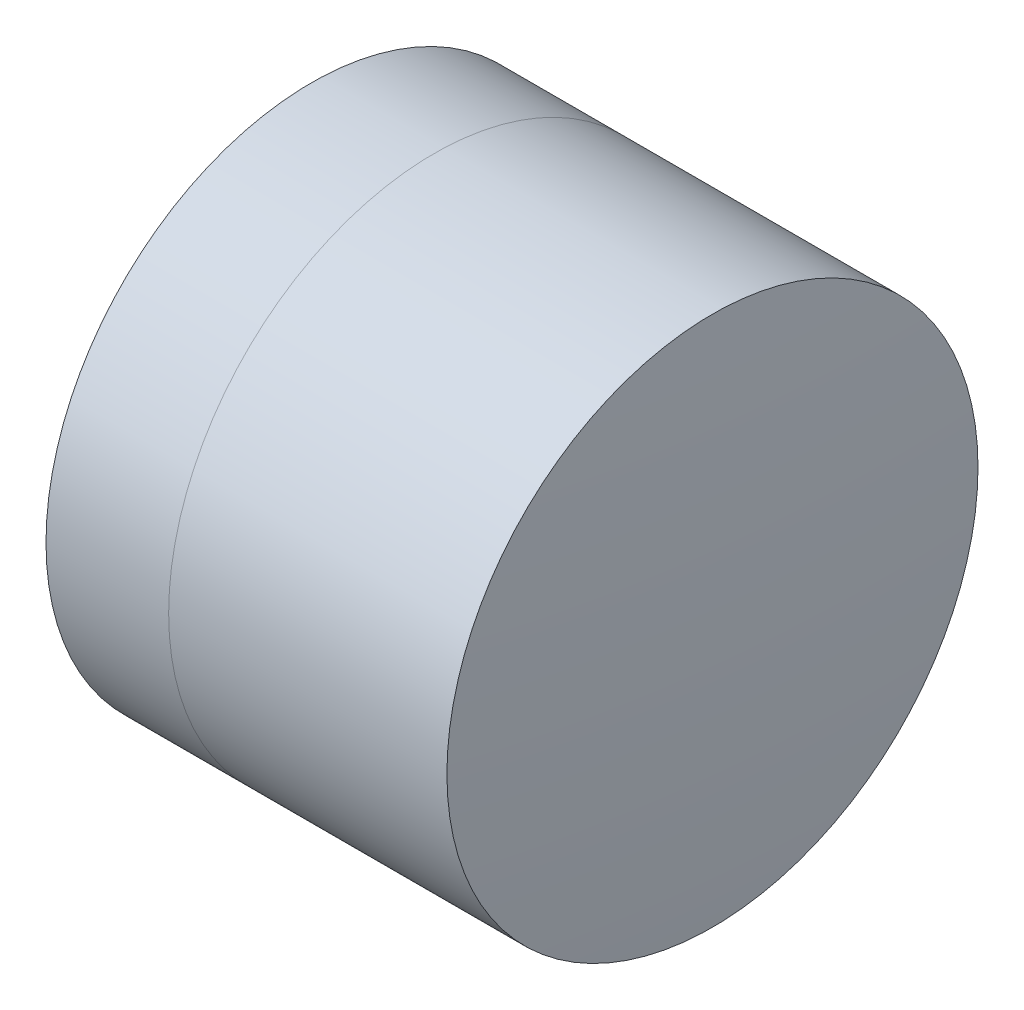
ISO-10303-21;
HEADER;
FILE_DESCRIPTION(('STEP AP214'),'2;1');
FILE_NAME('part.step','',(''),(''),'','','');
FILE_SCHEMA(('AUTOMOTIVE_DESIGN { 1 0 10303 214 1 1 1 1 }'));
ENDSEC;
DATA;
#1=APPLICATION_CONTEXT('core data for automotive mechanical design processes');
#2=APPLICATION_PROTOCOL_DEFINITION('international standard','automotive_design',2000,#1);
#3=PRODUCT_CONTEXT('',#1,'mechanical');
#4=PRODUCT('Part','Part','',(#3));
#5=PRODUCT_RELATED_PRODUCT_CATEGORY('part','',(#4));
#6=PRODUCT_DEFINITION_FORMATION('','',#4);
#7=PRODUCT_DEFINITION_CONTEXT('part definition',#1,'design');
#8=PRODUCT_DEFINITION('design','',#6,#7);
#9=PRODUCT_DEFINITION_SHAPE('','',#8);
#10=(LENGTH_UNIT() NAMED_UNIT(*) SI_UNIT(.MILLI.,.METRE.));
#11=(NAMED_UNIT(*) PLANE_ANGLE_UNIT() SI_UNIT($,.RADIAN.));
#12=(NAMED_UNIT(*) SI_UNIT($,.STERADIAN.) SOLID_ANGLE_UNIT());
#13=UNCERTAINTY_MEASURE_WITH_UNIT(LENGTH_MEASURE(1.E-05),#10,'distance_accuracy_value','');
#14=(GEOMETRIC_REPRESENTATION_CONTEXT(3) GLOBAL_UNCERTAINTY_ASSIGNED_CONTEXT((#13)) GLOBAL_UNIT_ASSIGNED_CONTEXT((#10,
#11,#12)) REPRESENTATION_CONTEXT('',''));
#15=CARTESIAN_POINT('',(0.,0.,0.));
#16=DIRECTION('',(0.,0.,1.));
#17=DIRECTION('',(1.,0.,0.));
#18=AXIS2_PLACEMENT_3D('',#15,#16,#17);
#19=CARTESIAN_POINT('',(255.632149058082,0.,0.));
#20=DIRECTION('',(-1.,0.,0.));
#21=DIRECTION('',(0.,0.,1.));
#22=AXIS2_PLACEMENT_3D('',#19,#20,#21);
#23=SPHERICAL_SURFACE('',#22,3.90000000000001);
#24=CARTESIAN_POINT('',(258.625474967501,0.,0.));
#25=DIRECTION('',(-1.,0.,0.));
#26=DIRECTION('',(0.,0.,1.));
#27=AXIS2_PLACEMENT_3D('',#24,#25,#26);
#28=CIRCLE('',#27,2.50000000000003);
#29=CARTESIAN_POINT('',(258.625474967501,0.,2.50000000000003));
#30=VERTEX_POINT('',#29);
#31=EDGE_CURVE('E11',#30,#30,#28,.T.);
#32=ORIENTED_EDGE('',*,*,#31,.T.);
#33=EDGE_LOOP('',(#32));
#34=FACE_BOUND('',#33,.T.);
#35=ADVANCED_FACE('F45',(#34),#23,.F.);
#36=CARTESIAN_POINT('',(-0.551919992657797,0.,0.));
#37=DIRECTION('',(-1.,0.,0.));
#38=DIRECTION('',(0.,0.,1.));
#39=AXIS2_PLACEMENT_3D('',#36,#37,#38);
#40=CYLINDRICAL_SURFACE('',#39,2.50000000000003);
#41=CARTESIAN_POINT('',(261.245238593793,0.,0.));
#42=DIRECTION('',(-1.,0.,0.));
#43=DIRECTION('',(0.,0.,1.));
#44=AXIS2_PLACEMENT_3D('',#41,#42,#43);
#45=CIRCLE('',#44,2.50000000000003);
#46=CARTESIAN_POINT('',(261.245238593793,0.,2.50000000000003));
#47=VERTEX_POINT('',#46);
#48=EDGE_CURVE('E51',#47,#47,#45,.T.);
#49=ORIENTED_EDGE('',*,*,#48,.T.);
#50=EDGE_LOOP('',(#49));
#51=FACE_BOUND('',#50,.T.);
#52=ORIENTED_EDGE('',*,*,#31,.F.);
#53=EDGE_LOOP('',(#52));
#54=FACE_BOUND('',#53,.T.);
#55=ADVANCED_FACE('F57',(#51,#54),#40,.T.);
#56=CARTESIAN_POINT('',(225.332149058082,0.,0.));
#57=DIRECTION('',(-1.,0.,0.));
#58=DIRECTION('',(0.,0.,1.));
#59=AXIS2_PLACEMENT_3D('',#56,#57,#58);
#60=SPHERICAL_SURFACE('',#59,36.);
#61=ORIENTED_EDGE('',*,*,#48,.F.);
#62=EDGE_LOOP('',(#61));
#63=FACE_BOUND('',#62,.T.);
#64=ADVANCED_FACE('F60',(#63),#60,.T.);
#65=CLOSED_SHELL('',(#35,#55,#64));
#66=MANIFOLD_SOLID_BREP('B2',#65);
#67=CARTESIAN_POINT('',(261.332149058082,0.,0.));
#68=DIRECTION('',(-1.,0.,0.));
#69=DIRECTION('',(0.,0.,-1.));
#70=AXIS2_PLACEMENT_3D('',#67,#68,#69);
#71=SPHERICAL_SURFACE('',#70,4.60000000000001);
#72=CARTESIAN_POINT('',(257.470802142821,0.,0.));
#73=DIRECTION('',(-1.,0.,0.));
#74=DIRECTION('',(0.,0.,1.));
#75=AXIS2_PLACEMENT_3D('',#72,#73,#74);
#76=CIRCLE('',#75,2.5);
#77=CARTESIAN_POINT('',(257.470802142821,0.,2.5));
#78=VERTEX_POINT('',#77);
#79=EDGE_CURVE('E44',#78,#78,#76,.T.);
#80=ORIENTED_EDGE('',*,*,#79,.T.);
#81=EDGE_LOOP('',(#80));
#82=FACE_BOUND('',#81,.T.);
#83=ADVANCED_FACE('F86',(#82),#71,.T.);
#84=CARTESIAN_POINT('',(124.523309526045,0.,0.));
#85=DIRECTION('',(-1.,0.,0.));
#86=DIRECTION('',(0.,0.,1.));
#87=AXIS2_PLACEMENT_3D('',#84,#85,#86);
#88=CYLINDRICAL_SURFACE('',#87,2.5);
#89=CARTESIAN_POINT('',(258.625474967501,0.,0.));
#90=DIRECTION('',(-1.,0.,0.));
#91=DIRECTION('',(0.,0.,1.));
#92=AXIS2_PLACEMENT_3D('',#89,#90,#91);
#93=CIRCLE('',#92,2.5);
#94=CARTESIAN_POINT('',(258.625474967501,0.,2.5));
#95=VERTEX_POINT('',#94);
#96=EDGE_CURVE('E92',#95,#95,#93,.T.);
#97=ORIENTED_EDGE('',*,*,#96,.T.);
#98=EDGE_LOOP('',(#97));
#99=FACE_BOUND('',#98,.T.);
#100=ORIENTED_EDGE('',*,*,#79,.F.);
#101=EDGE_LOOP('',(#100));
#102=FACE_BOUND('',#101,.T.);
#103=ADVANCED_FACE('F98',(#99,#102),#88,.T.);
#104=CARTESIAN_POINT('',(255.632149058082,0.,0.));
#105=DIRECTION('',(-1.,0.,0.));
#106=DIRECTION('',(0.,0.,1.));
#107=AXIS2_PLACEMENT_3D('',#104,#105,#106);
#108=SPHERICAL_SURFACE('',#107,3.90000000000001);
#109=ORIENTED_EDGE('',*,*,#96,.F.);
#110=EDGE_LOOP('',(#109));
#111=FACE_BOUND('',#110,.T.);
#112=ADVANCED_FACE('F101',(#111),#108,.T.);
#113=CLOSED_SHELL('',(#83,#103,#112));
#114=MANIFOLD_SOLID_BREP('B6',#113);
#115=ADVANCED_BREP_SHAPE_REPRESENTATION('',(#18,#66,#114),#14);
#116=SHAPE_DEFINITION_REPRESENTATION(#9,#115);
ENDSEC;
END-ISO-10303-21;
